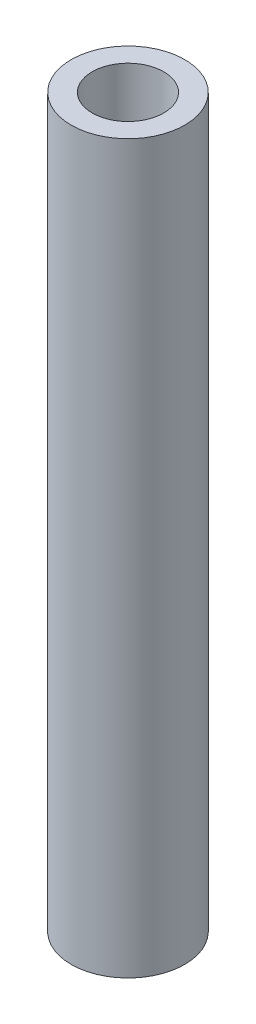
ISO-10303-21;
HEADER;
FILE_DESCRIPTION(('STEP AP214'),'2;1');
FILE_NAME('part.step','',(''),(''),'','','');
FILE_SCHEMA(('AUTOMOTIVE_DESIGN { 1 0 10303 214 1 1 1 1 }'));
ENDSEC;
DATA;
#1=APPLICATION_CONTEXT('core data for automotive mechanical design processes');
#2=APPLICATION_PROTOCOL_DEFINITION('international standard','automotive_design',2000,#1);
#3=PRODUCT_CONTEXT('',#1,'mechanical');
#4=PRODUCT('Part','Part','',(#3));
#5=PRODUCT_RELATED_PRODUCT_CATEGORY('part','',(#4));
#6=PRODUCT_DEFINITION_FORMATION('','',#4);
#7=PRODUCT_DEFINITION_CONTEXT('part definition',#1,'design');
#8=PRODUCT_DEFINITION('design','',#6,#7);
#9=PRODUCT_DEFINITION_SHAPE('','',#8);
#10=(LENGTH_UNIT() NAMED_UNIT(*) SI_UNIT(.MILLI.,.METRE.));
#11=(NAMED_UNIT(*) PLANE_ANGLE_UNIT() SI_UNIT($,.RADIAN.));
#12=(NAMED_UNIT(*) SI_UNIT($,.STERADIAN.) SOLID_ANGLE_UNIT());
#13=UNCERTAINTY_MEASURE_WITH_UNIT(LENGTH_MEASURE(1.E-05),#10,'distance_accuracy_value','');
#14=(GEOMETRIC_REPRESENTATION_CONTEXT(3) GLOBAL_UNCERTAINTY_ASSIGNED_CONTEXT((#13)) GLOBAL_UNIT_ASSIGNED_CONTEXT((#10,
#11,#12)) REPRESENTATION_CONTEXT('',''));
#15=CARTESIAN_POINT('',(0.,0.,0.));
#16=DIRECTION('',(0.,0.,1.));
#17=DIRECTION('',(1.,0.,0.));
#18=AXIS2_PLACEMENT_3D('',#15,#16,#17);
#19=CARTESIAN_POINT('',(0.,-40.64,0.));
#20=DIRECTION('',(0.,1.,0.));
#21=DIRECTION('',(0.,0.,1.));
#22=AXIS2_PLACEMENT_3D('',#19,#20,#21);
#23=CYLINDRICAL_SURFACE('',#22,3.175);
#24=CARTESIAN_POINT('',(0.,-40.64,0.));
#25=DIRECTION('',(0.,1.,0.));
#26=DIRECTION('',(0.,0.,1.));
#27=AXIS2_PLACEMENT_3D('',#24,#25,#26);
#28=CIRCLE('',#27,3.175);
#29=CARTESIAN_POINT('',(0.,-40.64,3.175));
#30=VERTEX_POINT('',#29);
#31=EDGE_CURVE('E10',#30,#30,#28,.T.);
#32=ORIENTED_EDGE('',*,*,#31,.T.);
#33=EDGE_LOOP('',(#32));
#34=FACE_BOUND('',#33,.T.);
#35=CARTESIAN_POINT('',(0.,0.,0.));
#36=DIRECTION('',(0.,1.,0.));
#37=DIRECTION('',(0.,0.,1.));
#38=AXIS2_PLACEMENT_3D('',#35,#36,#37);
#39=CIRCLE('',#38,3.175);
#40=CARTESIAN_POINT('',(0.,0.,3.175));
#41=VERTEX_POINT('',#40);
#42=EDGE_CURVE('E38',#41,#41,#39,.T.);
#43=ORIENTED_EDGE('',*,*,#42,.F.);
#44=EDGE_LOOP('',(#43));
#45=FACE_BOUND('',#44,.T.);
#46=ADVANCED_FACE('F35',(#34,#45),#23,.T.);
#47=CARTESIAN_POINT('',(0.,-40.64,0.));
#48=DIRECTION('',(0.,1.,0.));
#49=DIRECTION('',(0.,0.,1.));
#50=AXIS2_PLACEMENT_3D('',#47,#48,#49);
#51=PLANE('',#50);
#52=CARTESIAN_POINT('',(0.,-40.64,0.));
#53=DIRECTION('',(0.,1.,0.));
#54=DIRECTION('',(0.,0.,1.));
#55=AXIS2_PLACEMENT_3D('',#52,#53,#54);
#56=CIRCLE('',#55,2.);
#57=CARTESIAN_POINT('',(0.,-40.64,2.));
#58=VERTEX_POINT('',#57);
#59=EDGE_CURVE('E45',#58,#58,#56,.T.);
#60=ORIENTED_EDGE('',*,*,#59,.T.);
#61=EDGE_LOOP('',(#60));
#62=FACE_BOUND('',#61,.T.);
#63=ORIENTED_EDGE('',*,*,#31,.F.);
#64=EDGE_LOOP('',(#63));
#65=FACE_BOUND('',#64,.T.);
#66=ADVANCED_FACE('F53',(#62,#65),#51,.F.);
#67=CARTESIAN_POINT('',(0.,0.,0.));
#68=DIRECTION('',(0.,1.,0.));
#69=DIRECTION('',(0.,0.,1.));
#70=AXIS2_PLACEMENT_3D('',#67,#68,#69);
#71=PLANE('',#70);
#72=CARTESIAN_POINT('',(0.,0.,0.));
#73=DIRECTION('',(0.,1.,0.));
#74=DIRECTION('',(0.,0.,1.));
#75=AXIS2_PLACEMENT_3D('',#72,#73,#74);
#76=CIRCLE('',#75,2.);
#77=CARTESIAN_POINT('',(0.,0.,2.));
#78=VERTEX_POINT('',#77);
#79=EDGE_CURVE('E47',#78,#78,#76,.T.);
#80=ORIENTED_EDGE('',*,*,#79,.F.);
#81=EDGE_LOOP('',(#80));
#82=FACE_BOUND('',#81,.T.);
#83=ORIENTED_EDGE('',*,*,#42,.T.);
#84=EDGE_LOOP('',(#83));
#85=FACE_BOUND('',#84,.T.);
#86=ADVANCED_FACE('F59',(#82,#85),#71,.T.);
#87=CARTESIAN_POINT('',(0.,-40.64,0.));
#88=DIRECTION('',(0.,1.,0.));
#89=DIRECTION('',(0.,0.,1.));
#90=AXIS2_PLACEMENT_3D('',#87,#88,#89);
#91=CYLINDRICAL_SURFACE('',#90,2.);
#92=ORIENTED_EDGE('',*,*,#59,.F.);
#93=EDGE_LOOP('',(#92));
#94=FACE_BOUND('',#93,.T.);
#95=ORIENTED_EDGE('',*,*,#79,.T.);
#96=EDGE_LOOP('',(#95));
#97=FACE_BOUND('',#96,.T.);
#98=ADVANCED_FACE('F56',(#94,#97),#91,.F.);
#99=CLOSED_SHELL('',(#46,#66,#86,#98));
#100=MANIFOLD_SOLID_BREP('B2',#99);
#101=ADVANCED_BREP_SHAPE_REPRESENTATION('',(#18,#100),#14);
#102=SHAPE_DEFINITION_REPRESENTATION(#9,#101);
ENDSEC;
END-ISO-10303-21;
